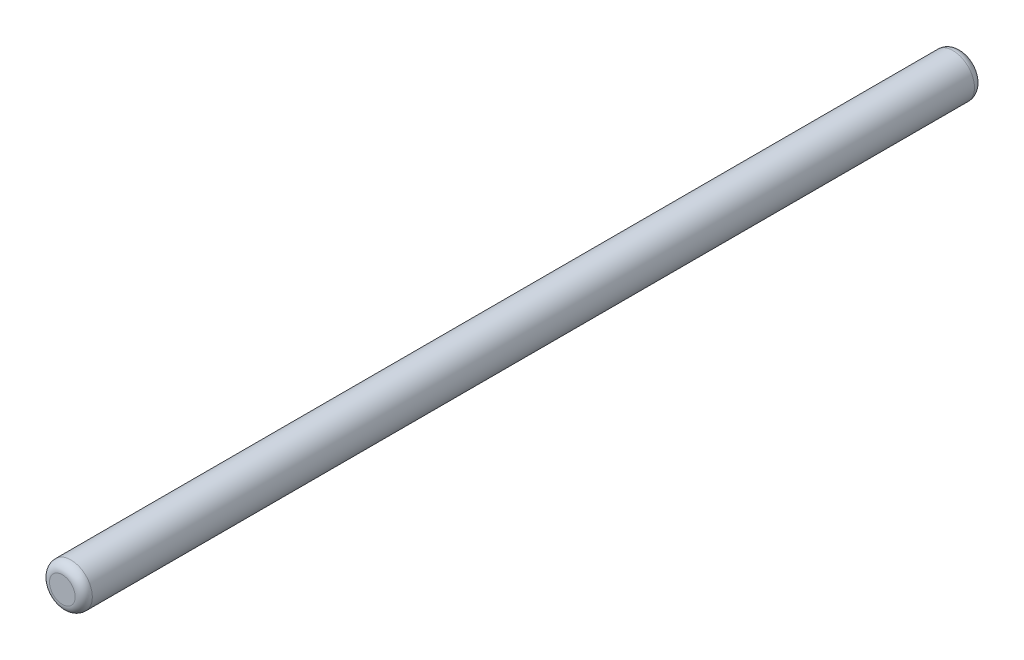
ISO-10303-21;
HEADER;
FILE_DESCRIPTION(('STEP AP214'),'2;1');
FILE_NAME('part.step','',(''),(''),'','','');
FILE_SCHEMA(('AUTOMOTIVE_DESIGN { 1 0 10303 214 1 1 1 1 }'));
ENDSEC;
DATA;
#1=APPLICATION_CONTEXT('core data for automotive mechanical design processes');
#2=APPLICATION_PROTOCOL_DEFINITION('international standard','automotive_design',2000,#1);
#3=PRODUCT_CONTEXT('',#1,'mechanical');
#4=PRODUCT('Part','Part','',(#3));
#5=PRODUCT_RELATED_PRODUCT_CATEGORY('part','',(#4));
#6=PRODUCT_DEFINITION_FORMATION('','',#4);
#7=PRODUCT_DEFINITION_CONTEXT('part definition',#1,'design');
#8=PRODUCT_DEFINITION('design','',#6,#7);
#9=PRODUCT_DEFINITION_SHAPE('','',#8);
#10=(LENGTH_UNIT() NAMED_UNIT(*) SI_UNIT(.MILLI.,.METRE.));
#11=(NAMED_UNIT(*) PLANE_ANGLE_UNIT() SI_UNIT($,.RADIAN.));
#12=(NAMED_UNIT(*) SI_UNIT($,.STERADIAN.) SOLID_ANGLE_UNIT());
#13=UNCERTAINTY_MEASURE_WITH_UNIT(LENGTH_MEASURE(1.E-05),#10,'distance_accuracy_value','');
#14=(GEOMETRIC_REPRESENTATION_CONTEXT(3) GLOBAL_UNCERTAINTY_ASSIGNED_CONTEXT((#13)) GLOBAL_UNIT_ASSIGNED_CONTEXT((#10,
#11,#12)) REPRESENTATION_CONTEXT('',''));
#15=CARTESIAN_POINT('',(0.,0.,0.));
#16=DIRECTION('',(0.,0.,1.));
#17=DIRECTION('',(1.,0.,0.));
#18=AXIS2_PLACEMENT_3D('',#15,#16,#17);
#19=CARTESIAN_POINT('',(0.,0.,105.));
#20=DIRECTION('',(0.,0.,-1.));
#21=DIRECTION('',(-1.,0.,0.));
#22=AXIS2_PLACEMENT_3D('',#19,#20,#21);
#23=CYLINDRICAL_SURFACE('',#22,2.5);
#24=CARTESIAN_POINT('',(0.,0.,1.));
#25=DIRECTION('',(0.,0.,1.));
#26=DIRECTION('',(1.,0.,0.));
#27=AXIS2_PLACEMENT_3D('',#24,#25,#26);
#28=CIRCLE('',#27,2.5);
#29=CARTESIAN_POINT('',(2.5,0.,1.));
#30=VERTEX_POINT('',#29);
#31=EDGE_CURVE('E41',#30,#30,#28,.T.);
#32=ORIENTED_EDGE('',*,*,#31,.T.);
#33=EDGE_LOOP('',(#32));
#34=FACE_BOUND('',#33,.T.);
#35=CARTESIAN_POINT('',(0.,0.,104.));
#36=DIRECTION('',(0.,0.,1.));
#37=DIRECTION('',(1.,0.,0.));
#38=AXIS2_PLACEMENT_3D('',#35,#36,#37);
#39=CIRCLE('',#38,2.5);
#40=CARTESIAN_POINT('',(2.5,0.,104.));
#41=VERTEX_POINT('',#40);
#42=EDGE_CURVE('E45',#41,#41,#39,.F.);
#43=ORIENTED_EDGE('',*,*,#42,.T.);
#44=EDGE_LOOP('',(#43));
#45=FACE_BOUND('',#44,.T.);
#46=ADVANCED_FACE('F30',(#34,#45),#23,.T.);
#47=CARTESIAN_POINT('',(0.,0.,105.));
#48=DIRECTION('',(0.,0.,1.));
#49=DIRECTION('',(1.,0.,0.));
#50=AXIS2_PLACEMENT_3D('',#47,#48,#49);
#51=PLANE('',#50);
#52=CARTESIAN_POINT('',(0.,0.,105.));
#53=DIRECTION('',(0.,0.,1.));
#54=DIRECTION('',(1.,0.,0.));
#55=AXIS2_PLACEMENT_3D('',#52,#53,#54);
#56=CIRCLE('',#55,1.5);
#57=CARTESIAN_POINT('',(1.5,0.,105.));
#58=VERTEX_POINT('',#57);
#59=EDGE_CURVE('E10',#58,#58,#56,.T.);
#60=ORIENTED_EDGE('',*,*,#59,.T.);
#61=EDGE_LOOP('',(#60));
#62=FACE_BOUND('',#61,.T.);
#63=ADVANCED_FACE('F61',(#62),#51,.T.);
#64=CARTESIAN_POINT('',(0.,0.,0.));
#65=DIRECTION('',(0.,0.,1.));
#66=DIRECTION('',(1.,0.,0.));
#67=AXIS2_PLACEMENT_3D('',#64,#65,#66);
#68=PLANE('',#67);
#69=CARTESIAN_POINT('',(0.,0.,0.));
#70=DIRECTION('',(0.,0.,1.));
#71=DIRECTION('',(1.,0.,0.));
#72=AXIS2_PLACEMENT_3D('',#69,#70,#71);
#73=CIRCLE('',#72,1.5);
#74=CARTESIAN_POINT('',(1.5,0.,0.));
#75=VERTEX_POINT('',#74);
#76=EDGE_CURVE('E37',#75,#75,#73,.F.);
#77=ORIENTED_EDGE('',*,*,#76,.T.);
#78=EDGE_LOOP('',(#77));
#79=FACE_BOUND('',#78,.T.);
#80=ADVANCED_FACE('F58',(#79),#68,.F.);
#81=CARTESIAN_POINT('',(0.,0.,1.));
#82=DIRECTION('',(0.,0.,1.));
#83=DIRECTION('',(1.,0.,0.));
#84=AXIS2_PLACEMENT_3D('',#81,#82,#83);
#85=TOROIDAL_SURFACE('',#84,1.5,1.);
#86=ORIENTED_EDGE('',*,*,#76,.F.);
#87=EDGE_LOOP('',(#86));
#88=FACE_BOUND('',#87,.T.);
#89=ORIENTED_EDGE('',*,*,#31,.F.);
#90=EDGE_LOOP('',(#89));
#91=FACE_BOUND('',#90,.T.);
#92=ADVANCED_FACE('F54',(#88,#91),#85,.T.);
#93=CARTESIAN_POINT('',(0.,0.,104.));
#94=DIRECTION('',(0.,0.,1.));
#95=DIRECTION('',(1.,0.,0.));
#96=AXIS2_PLACEMENT_3D('',#93,#94,#95);
#97=TOROIDAL_SURFACE('',#96,1.5,1.);
#98=ORIENTED_EDGE('',*,*,#42,.F.);
#99=EDGE_LOOP('',(#98));
#100=FACE_BOUND('',#99,.T.);
#101=ORIENTED_EDGE('',*,*,#59,.F.);
#102=EDGE_LOOP('',(#101));
#103=FACE_BOUND('',#102,.T.);
#104=ADVANCED_FACE('F32',(#100,#103),#97,.T.);
#105=CLOSED_SHELL('',(#46,#63,#80,#92,#104));
#106=MANIFOLD_SOLID_BREP('B2',#105);
#107=ADVANCED_BREP_SHAPE_REPRESENTATION('',(#18,#106),#14);
#108=SHAPE_DEFINITION_REPRESENTATION(#9,#107);
ENDSEC;
END-ISO-10303-21;
